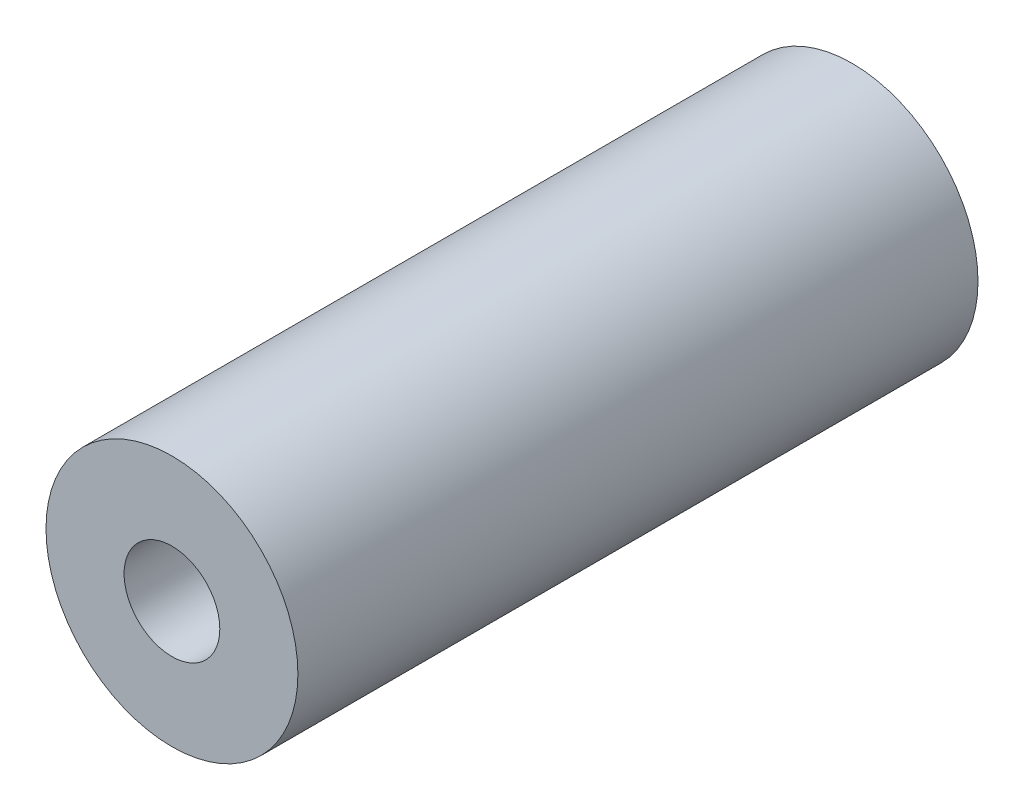
ISO-10303-21;
HEADER;
FILE_DESCRIPTION(('STEP AP214'),'2;1');
FILE_NAME('part.step','',(''),(''),'','','');
FILE_SCHEMA(('AUTOMOTIVE_DESIGN { 1 0 10303 214 1 1 1 1 }'));
ENDSEC;
DATA;
#1=APPLICATION_CONTEXT('core data for automotive mechanical design processes');
#2=APPLICATION_PROTOCOL_DEFINITION('international standard','automotive_design',2000,#1);
#3=PRODUCT_CONTEXT('',#1,'mechanical');
#4=PRODUCT('Part','Part','',(#3));
#5=PRODUCT_RELATED_PRODUCT_CATEGORY('part','',(#4));
#6=PRODUCT_DEFINITION_FORMATION('','',#4);
#7=PRODUCT_DEFINITION_CONTEXT('part definition',#1,'design');
#8=PRODUCT_DEFINITION('design','',#6,#7);
#9=PRODUCT_DEFINITION_SHAPE('','',#8);
#10=(LENGTH_UNIT() NAMED_UNIT(*) SI_UNIT(.MILLI.,.METRE.));
#11=(NAMED_UNIT(*) PLANE_ANGLE_UNIT() SI_UNIT($,.RADIAN.));
#12=(NAMED_UNIT(*) SI_UNIT($,.STERADIAN.) SOLID_ANGLE_UNIT());
#13=UNCERTAINTY_MEASURE_WITH_UNIT(LENGTH_MEASURE(1.E-05),#10,'distance_accuracy_value','');
#14=(GEOMETRIC_REPRESENTATION_CONTEXT(3) GLOBAL_UNCERTAINTY_ASSIGNED_CONTEXT((#13)) GLOBAL_UNIT_ASSIGNED_CONTEXT((#10,
#11,#12)) REPRESENTATION_CONTEXT('',''));
#15=CARTESIAN_POINT('',(0.,0.,0.));
#16=DIRECTION('',(0.,0.,1.));
#17=DIRECTION('',(1.,0.,0.));
#18=AXIS2_PLACEMENT_3D('',#15,#16,#17);
#19=CARTESIAN_POINT('',(0.,0.,34.29));
#20=DIRECTION('',(0.,0.,1.));
#21=DIRECTION('',(1.,0.,0.));
#22=AXIS2_PLACEMENT_3D('',#19,#20,#21);
#23=PLANE('',#22);
#24=CARTESIAN_POINT('',(0.,0.,34.29));
#25=DIRECTION('',(0.,0.,1.));
#26=DIRECTION('',(1.,0.,0.));
#27=AXIS2_PLACEMENT_3D('',#24,#25,#26);
#28=CIRCLE('',#27,6.35);
#29=CARTESIAN_POINT('',(6.35,0.,34.29));
#30=VERTEX_POINT('',#29);
#31=EDGE_CURVE('E10',#30,#30,#28,.T.);
#32=ORIENTED_EDGE('',*,*,#31,.T.);
#33=EDGE_LOOP('',(#32));
#34=FACE_BOUND('',#33,.T.);
#35=CARTESIAN_POINT('',(0.,0.,34.29));
#36=DIRECTION('',(0.,0.,1.));
#37=DIRECTION('',(1.,0.,0.));
#38=AXIS2_PLACEMENT_3D('',#35,#36,#37);
#39=CIRCLE('',#38,2.413);
#40=CARTESIAN_POINT('',(2.413,0.,34.29));
#41=VERTEX_POINT('',#40);
#42=EDGE_CURVE('E43',#41,#41,#39,.T.);
#43=ORIENTED_EDGE('',*,*,#42,.F.);
#44=EDGE_LOOP('',(#43));
#45=FACE_BOUND('',#44,.T.);
#46=ADVANCED_FACE('F32',(#34,#45),#23,.T.);
#47=CARTESIAN_POINT('',(0.,0.,0.));
#48=DIRECTION('',(0.,0.,1.));
#49=DIRECTION('',(1.,0.,0.));
#50=AXIS2_PLACEMENT_3D('',#47,#48,#49);
#51=PLANE('',#50);
#52=CARTESIAN_POINT('',(0.,0.,0.));
#53=DIRECTION('',(0.,0.,1.));
#54=DIRECTION('',(1.,0.,0.));
#55=AXIS2_PLACEMENT_3D('',#52,#53,#54);
#56=CIRCLE('',#55,6.35);
#57=CARTESIAN_POINT('',(6.35,0.,0.));
#58=VERTEX_POINT('',#57);
#59=EDGE_CURVE('E36',#58,#58,#56,.T.);
#60=ORIENTED_EDGE('',*,*,#59,.F.);
#61=EDGE_LOOP('',(#60));
#62=FACE_BOUND('',#61,.T.);
#63=CARTESIAN_POINT('',(0.,0.,0.));
#64=DIRECTION('',(0.,0.,1.));
#65=DIRECTION('',(1.,0.,0.));
#66=AXIS2_PLACEMENT_3D('',#63,#64,#65);
#67=CIRCLE('',#66,2.413);
#68=CARTESIAN_POINT('',(2.413,0.,0.));
#69=VERTEX_POINT('',#68);
#70=EDGE_CURVE('E45',#69,#69,#67,.T.);
#71=ORIENTED_EDGE('',*,*,#70,.T.);
#72=EDGE_LOOP('',(#71));
#73=FACE_BOUND('',#72,.T.);
#74=ADVANCED_FACE('F55',(#62,#73),#51,.F.);
#75=CARTESIAN_POINT('',(0.,0.,34.29));
#76=DIRECTION('',(0.,0.,-1.));
#77=DIRECTION('',(-1.,0.,0.));
#78=AXIS2_PLACEMENT_3D('',#75,#76,#77);
#79=CYLINDRICAL_SURFACE('',#78,6.35);
#80=ORIENTED_EDGE('',*,*,#31,.F.);
#81=EDGE_LOOP('',(#80));
#82=FACE_BOUND('',#81,.T.);
#83=ORIENTED_EDGE('',*,*,#59,.T.);
#84=EDGE_LOOP('',(#83));
#85=FACE_BOUND('',#84,.T.);
#86=ADVANCED_FACE('F34',(#82,#85),#79,.T.);
#87=CARTESIAN_POINT('',(0.,0.,34.29));
#88=DIRECTION('',(0.,0.,-1.));
#89=DIRECTION('',(-1.,0.,0.));
#90=AXIS2_PLACEMENT_3D('',#87,#88,#89);
#91=CYLINDRICAL_SURFACE('',#90,2.413);
#92=ORIENTED_EDGE('',*,*,#42,.T.);
#93=EDGE_LOOP('',(#92));
#94=FACE_BOUND('',#93,.T.);
#95=ORIENTED_EDGE('',*,*,#70,.F.);
#96=EDGE_LOOP('',(#95));
#97=FACE_BOUND('',#96,.T.);
#98=ADVANCED_FACE('F51',(#94,#97),#91,.F.);
#99=CLOSED_SHELL('',(#46,#74,#86,#98));
#100=MANIFOLD_SOLID_BREP('B2',#99);
#101=ADVANCED_BREP_SHAPE_REPRESENTATION('',(#18,#100),#14);
#102=SHAPE_DEFINITION_REPRESENTATION(#9,#101);
ENDSEC;
END-ISO-10303-21;
